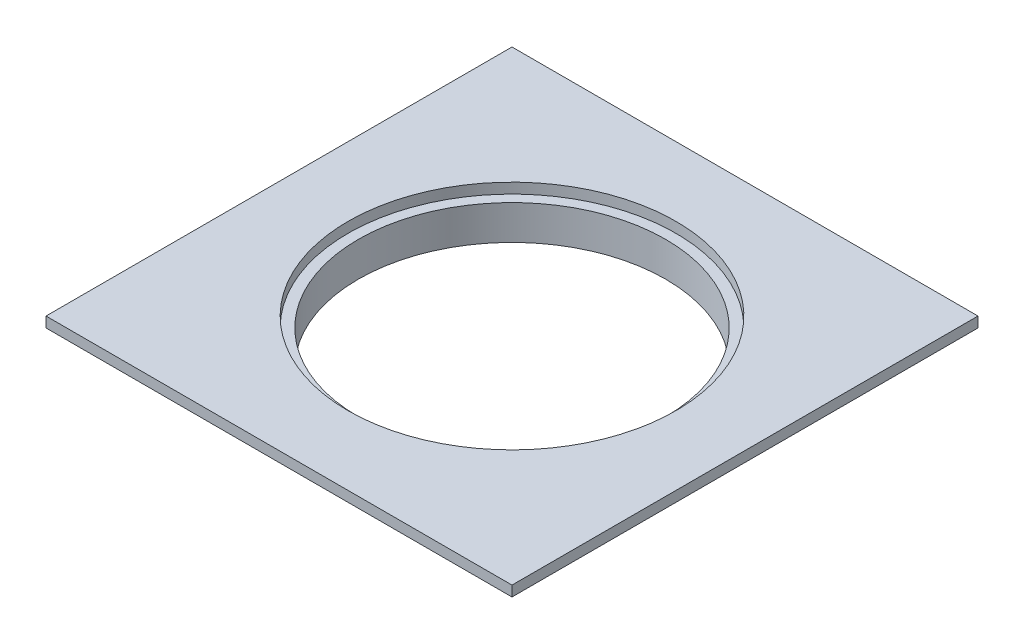
ISO-10303-21;
HEADER;
FILE_DESCRIPTION(('STEP AP214'),'2;1');
FILE_NAME('part.step','',(''),(''),'','','');
FILE_SCHEMA(('AUTOMOTIVE_DESIGN { 1 0 10303 214 1 1 1 1 }'));
ENDSEC;
DATA;
#1=APPLICATION_CONTEXT('core data for automotive mechanical design processes');
#2=APPLICATION_PROTOCOL_DEFINITION('international standard','automotive_design',2000,#1);
#3=PRODUCT_CONTEXT('',#1,'mechanical');
#4=PRODUCT('Part','Part','',(#3));
#5=PRODUCT_RELATED_PRODUCT_CATEGORY('part','',(#4));
#6=PRODUCT_DEFINITION_FORMATION('','',#4);
#7=PRODUCT_DEFINITION_CONTEXT('part definition',#1,'design');
#8=PRODUCT_DEFINITION('design','',#6,#7);
#9=PRODUCT_DEFINITION_SHAPE('','',#8);
#10=(LENGTH_UNIT() NAMED_UNIT(*) SI_UNIT(.MILLI.,.METRE.));
#11=(NAMED_UNIT(*) PLANE_ANGLE_UNIT() SI_UNIT($,.RADIAN.));
#12=(NAMED_UNIT(*) SI_UNIT($,.STERADIAN.) SOLID_ANGLE_UNIT());
#13=UNCERTAINTY_MEASURE_WITH_UNIT(LENGTH_MEASURE(1.E-05),#10,'distance_accuracy_value','');
#14=(GEOMETRIC_REPRESENTATION_CONTEXT(3) GLOBAL_UNCERTAINTY_ASSIGNED_CONTEXT((#13)) GLOBAL_UNIT_ASSIGNED_CONTEXT((#10,
#11,#12)) REPRESENTATION_CONTEXT('',''));
#15=CARTESIAN_POINT('',(0.,0.,0.));
#16=DIRECTION('',(0.,0.,1.));
#17=DIRECTION('',(1.,0.,0.));
#18=AXIS2_PLACEMENT_3D('',#15,#16,#17);
#19=CARTESIAN_POINT('',(0.,3.,0.));
#20=DIRECTION('',(0.,-1.,0.));
#21=DIRECTION('',(0.,0.,-1.));
#22=AXIS2_PLACEMENT_3D('',#19,#20,#21);
#23=PLANE('',#22);
#24=DIRECTION('',(0.,0.,-1.));
#25=VECTOR('',#24,1.);
#26=CARTESIAN_POINT('',(67.5,3.,67.5));
#27=LINE('',#26,#25);
#28=CARTESIAN_POINT('',(67.5,3.,67.5));
#29=VERTEX_POINT('',#28);
#30=CARTESIAN_POINT('',(67.5,3.,-67.5));
#31=VERTEX_POINT('',#30);
#32=EDGE_CURVE('E95',#29,#31,#27,.T.);
#33=ORIENTED_EDGE('',*,*,#32,.T.);
#34=DIRECTION('',(-1.,0.,0.));
#35=VECTOR('',#34,1.);
#36=CARTESIAN_POINT('',(-67.5,3.,-67.5));
#37=LINE('',#36,#35);
#38=CARTESIAN_POINT('',(-67.5,3.,-67.5));
#39=VERTEX_POINT('',#38);
#40=EDGE_CURVE('E90',#31,#39,#37,.T.);
#41=ORIENTED_EDGE('',*,*,#40,.T.);
#42=DIRECTION('',(0.,0.,1.));
#43=VECTOR('',#42,1.);
#44=CARTESIAN_POINT('',(-67.5,3.,67.5));
#45=LINE('',#44,#43);
#46=CARTESIAN_POINT('',(-67.5,3.,67.5));
#47=VERTEX_POINT('',#46);
#48=EDGE_CURVE('E93',#39,#47,#45,.T.);
#49=ORIENTED_EDGE('',*,*,#48,.T.);
#50=DIRECTION('',(1.,0.,0.));
#51=VECTOR('',#50,1.);
#52=CARTESIAN_POINT('',(-67.5,3.,67.5));
#53=LINE('',#52,#51);
#54=EDGE_CURVE('E60',#47,#29,#53,.T.);
#55=ORIENTED_EDGE('',*,*,#54,.T.);
#56=EDGE_LOOP('',(#33,#41,#49,#55));
#57=FACE_BOUND('',#56,.T.);
#58=CARTESIAN_POINT('',(0.,3.,0.));
#59=DIRECTION('',(0.,1.,0.));
#60=DIRECTION('',(0.,0.,1.));
#61=AXIS2_PLACEMENT_3D('',#58,#59,#60);
#62=CIRCLE('',#61,47.5);
#63=CARTESIAN_POINT('',(0.,3.,47.5));
#64=VERTEX_POINT('',#63);
#65=EDGE_CURVE('E110',#64,#64,#62,.T.);
#66=ORIENTED_EDGE('',*,*,#65,.F.);
#67=EDGE_LOOP('',(#66));
#68=FACE_BOUND('',#67,.T.);
#69=ADVANCED_FACE('F43',(#57,#68),#23,.F.);
#70=CARTESIAN_POINT('',(0.,0.,0.));
#71=DIRECTION('',(0.,-1.,0.));
#72=DIRECTION('',(0.,0.,-1.));
#73=AXIS2_PLACEMENT_3D('',#70,#71,#72);
#74=PLANE('',#73);
#75=CARTESIAN_POINT('',(0.,0.,0.));
#76=DIRECTION('',(0.,-1.,0.));
#77=DIRECTION('',(0.,0.,-1.));
#78=AXIS2_PLACEMENT_3D('',#75,#76,#77);
#79=CIRCLE('',#78,55.);
#80=CARTESIAN_POINT('',(0.,0.,-55.));
#81=VERTEX_POINT('',#80);
#82=EDGE_CURVE('E127',#81,#81,#79,.T.);
#83=ORIENTED_EDGE('',*,*,#82,.F.);
#84=EDGE_LOOP('',(#83));
#85=FACE_BOUND('',#84,.T.);
#86=DIRECTION('',(0.,0.,-1.));
#87=VECTOR('',#86,1.);
#88=CARTESIAN_POINT('',(67.5,0.,67.5));
#89=LINE('',#88,#87);
#90=CARTESIAN_POINT('',(67.5,0.,67.5));
#91=VERTEX_POINT('',#90);
#92=CARTESIAN_POINT('',(67.5,0.,-67.5));
#93=VERTEX_POINT('',#92);
#94=EDGE_CURVE('E107',#91,#93,#89,.T.);
#95=ORIENTED_EDGE('',*,*,#94,.F.);
#96=DIRECTION('',(1.,0.,0.));
#97=VECTOR('',#96,1.);
#98=CARTESIAN_POINT('',(-67.5,0.,67.5));
#99=LINE('',#98,#97);
#100=CARTESIAN_POINT('',(-67.5,0.,67.5));
#101=VERTEX_POINT('',#100);
#102=EDGE_CURVE('E83',#101,#91,#99,.T.);
#103=ORIENTED_EDGE('',*,*,#102,.F.);
#104=DIRECTION('',(0.,0.,1.));
#105=VECTOR('',#104,1.);
#106=CARTESIAN_POINT('',(-67.5,0.,67.5));
#107=LINE('',#106,#105);
#108=CARTESIAN_POINT('',(-67.5,0.,-67.5));
#109=VERTEX_POINT('',#108);
#110=EDGE_CURVE('E77',#109,#101,#107,.T.);
#111=ORIENTED_EDGE('',*,*,#110,.F.);
#112=DIRECTION('',(-1.,0.,0.));
#113=VECTOR('',#112,1.);
#114=CARTESIAN_POINT('',(-67.5,0.,-67.5));
#115=LINE('',#114,#113);
#116=EDGE_CURVE('E99',#93,#109,#115,.T.);
#117=ORIENTED_EDGE('',*,*,#116,.F.);
#118=EDGE_LOOP('',(#95,#103,#111,#117));
#119=FACE_BOUND('',#118,.T.);
#120=ADVANCED_FACE('F118',(#85,#119),#74,.T.);
#121=CARTESIAN_POINT('',(67.5,3.,67.5));
#122=DIRECTION('',(-1.,0.,0.));
#123=DIRECTION('',(0.,0.,1.));
#124=AXIS2_PLACEMENT_3D('',#121,#122,#123);
#125=PLANE('',#124);
#126=ORIENTED_EDGE('',*,*,#94,.T.);
#127=DIRECTION('',(0.,-1.,0.));
#128=VECTOR('',#127,1.);
#129=CARTESIAN_POINT('',(67.5,3.,-67.5));
#130=LINE('',#129,#128);
#131=EDGE_CURVE('E12',#31,#93,#130,.T.);
#132=ORIENTED_EDGE('',*,*,#131,.F.);
#133=ORIENTED_EDGE('',*,*,#32,.F.);
#134=DIRECTION('',(0.,-1.,0.));
#135=VECTOR('',#134,1.);
#136=CARTESIAN_POINT('',(67.5,3.,67.5));
#137=LINE('',#136,#135);
#138=EDGE_CURVE('E103',#29,#91,#137,.T.);
#139=ORIENTED_EDGE('',*,*,#138,.T.);
#140=EDGE_LOOP('',(#126,#132,#133,#139));
#141=FACE_BOUND('',#140,.T.);
#142=ADVANCED_FACE('F45',(#141),#125,.F.);
#143=CARTESIAN_POINT('',(-67.5,3.,-67.5));
#144=DIRECTION('',(0.,0.,1.));
#145=DIRECTION('',(1.,0.,0.));
#146=AXIS2_PLACEMENT_3D('',#143,#144,#145);
#147=PLANE('',#146);
#148=ORIENTED_EDGE('',*,*,#116,.T.);
#149=DIRECTION('',(0.,-1.,0.));
#150=VECTOR('',#149,1.);
#151=CARTESIAN_POINT('',(-67.5,3.,-67.5));
#152=LINE('',#151,#150);
#153=EDGE_CURVE('E52',#39,#109,#152,.T.);
#154=ORIENTED_EDGE('',*,*,#153,.F.);
#155=ORIENTED_EDGE('',*,*,#40,.F.);
#156=ORIENTED_EDGE('',*,*,#131,.T.);
#157=EDGE_LOOP('',(#148,#154,#155,#156));
#158=FACE_BOUND('',#157,.T.);
#159=ADVANCED_FACE('F98',(#158),#147,.F.);
#160=CARTESIAN_POINT('',(-67.5,3.,67.5));
#161=DIRECTION('',(1.,0.,0.));
#162=DIRECTION('',(0.,0.,-1.));
#163=AXIS2_PLACEMENT_3D('',#160,#161,#162);
#164=PLANE('',#163);
#165=ORIENTED_EDGE('',*,*,#110,.T.);
#166=DIRECTION('',(0.,-1.,0.));
#167=VECTOR('',#166,1.);
#168=CARTESIAN_POINT('',(-67.5,3.,67.5));
#169=LINE('',#168,#167);
#170=EDGE_CURVE('E100',#47,#101,#169,.T.);
#171=ORIENTED_EDGE('',*,*,#170,.F.);
#172=ORIENTED_EDGE('',*,*,#48,.F.);
#173=ORIENTED_EDGE('',*,*,#153,.T.);
#174=EDGE_LOOP('',(#165,#171,#172,#173));
#175=FACE_BOUND('',#174,.T.);
#176=ADVANCED_FACE('F101',(#175),#164,.F.);
#177=CARTESIAN_POINT('',(-67.5,3.,67.5));
#178=DIRECTION('',(0.,0.,-1.));
#179=DIRECTION('',(-1.,0.,0.));
#180=AXIS2_PLACEMENT_3D('',#177,#178,#179);
#181=PLANE('',#180);
#182=ORIENTED_EDGE('',*,*,#102,.T.);
#183=ORIENTED_EDGE('',*,*,#138,.F.);
#184=ORIENTED_EDGE('',*,*,#54,.F.);
#185=ORIENTED_EDGE('',*,*,#170,.T.);
#186=EDGE_LOOP('',(#182,#183,#184,#185));
#187=FACE_BOUND('',#186,.T.);
#188=ADVANCED_FACE('F115',(#187),#181,.F.);
#189=CARTESIAN_POINT('',(0.,3.,0.));
#190=DIRECTION('',(0.,-1.,0.));
#191=DIRECTION('',(0.,0.,-1.));
#192=AXIS2_PLACEMENT_3D('',#189,#190,#191);
#193=CYLINDRICAL_SURFACE('',#192,47.5);
#194=ORIENTED_EDGE('',*,*,#65,.T.);
#195=EDGE_LOOP('',(#194));
#196=FACE_BOUND('',#195,.T.);
#197=CARTESIAN_POINT('',(0.,0.,0.));
#198=DIRECTION('',(0.,1.,0.));
#199=DIRECTION('',(0.,0.,1.));
#200=AXIS2_PLACEMENT_3D('',#197,#198,#199);
#201=CIRCLE('',#200,47.5);
#202=CARTESIAN_POINT('',(0.,0.,47.5));
#203=VERTEX_POINT('',#202);
#204=EDGE_CURVE('E121',#203,#203,#201,.T.);
#205=ORIENTED_EDGE('',*,*,#204,.F.);
#206=EDGE_LOOP('',(#205));
#207=FACE_BOUND('',#206,.T.);
#208=ADVANCED_FACE('F154',(#196,#207),#193,.F.);
#209=CARTESIAN_POINT('',(0.,0.,0.));
#210=DIRECTION('',(0.,-1.,0.));
#211=DIRECTION('',(0.,0.,-1.));
#212=AXIS2_PLACEMENT_3D('',#209,#210,#211);
#213=PLANE('',#212);
#214=CARTESIAN_POINT('',(0.,0.,0.));
#215=DIRECTION('',(0.,-1.,0.));
#216=DIRECTION('',(0.,0.,-1.));
#217=AXIS2_PLACEMENT_3D('',#214,#215,#216);
#218=CIRCLE('',#217,44.5);
#219=CARTESIAN_POINT('',(0.,0.,-44.5));
#220=VERTEX_POINT('',#219);
#221=EDGE_CURVE('E133',#220,#220,#218,.T.);
#222=ORIENTED_EDGE('',*,*,#221,.T.);
#223=EDGE_LOOP('',(#222));
#224=FACE_BOUND('',#223,.T.);
#225=ORIENTED_EDGE('',*,*,#204,.T.);
#226=EDGE_LOOP('',(#225));
#227=FACE_BOUND('',#226,.T.);
#228=ADVANCED_FACE('F145',(#224,#227),#213,.F.);
#229=CARTESIAN_POINT('',(0.,-10.,0.));
#230=DIRECTION('',(0.,-1.,0.));
#231=DIRECTION('',(0.,0.,-1.));
#232=AXIS2_PLACEMENT_3D('',#229,#230,#231);
#233=PLANE('',#232);
#234=CARTESIAN_POINT('',(0.,-10.,0.));
#235=DIRECTION('',(0.,-1.,0.));
#236=DIRECTION('',(0.,0.,-1.));
#237=AXIS2_PLACEMENT_3D('',#234,#235,#236);
#238=CIRCLE('',#237,55.);
#239=CARTESIAN_POINT('',(0.,-10.,-55.));
#240=VERTEX_POINT('',#239);
#241=EDGE_CURVE('E124',#240,#240,#238,.T.);
#242=ORIENTED_EDGE('',*,*,#241,.T.);
#243=EDGE_LOOP('',(#242));
#244=FACE_BOUND('',#243,.T.);
#245=CARTESIAN_POINT('',(0.,-10.,0.));
#246=DIRECTION('',(0.,-1.,0.));
#247=DIRECTION('',(0.,0.,-1.));
#248=AXIS2_PLACEMENT_3D('',#245,#246,#247);
#249=CIRCLE('',#248,44.5);
#250=CARTESIAN_POINT('',(0.,-10.,-44.5));
#251=VERTEX_POINT('',#250);
#252=EDGE_CURVE('E130',#251,#251,#249,.T.);
#253=ORIENTED_EDGE('',*,*,#252,.F.);
#254=EDGE_LOOP('',(#253));
#255=FACE_BOUND('',#254,.T.);
#256=ADVANCED_FACE('F142',(#244,#255),#233,.T.);
#257=CARTESIAN_POINT('',(0.,-10.,0.));
#258=DIRECTION('',(0.,1.,0.));
#259=DIRECTION('',(0.,0.,1.));
#260=AXIS2_PLACEMENT_3D('',#257,#258,#259);
#261=CYLINDRICAL_SURFACE('',#260,55.);
#262=ORIENTED_EDGE('',*,*,#241,.F.);
#263=EDGE_LOOP('',(#262));
#264=FACE_BOUND('',#263,.T.);
#265=ORIENTED_EDGE('',*,*,#82,.T.);
#266=EDGE_LOOP('',(#265));
#267=FACE_BOUND('',#266,.T.);
#268=ADVANCED_FACE('F144',(#264,#267),#261,.T.);
#269=CARTESIAN_POINT('',(0.,-10.,0.));
#270=DIRECTION('',(0.,1.,0.));
#271=DIRECTION('',(0.,0.,1.));
#272=AXIS2_PLACEMENT_3D('',#269,#270,#271);
#273=CYLINDRICAL_SURFACE('',#272,44.5);
#274=ORIENTED_EDGE('',*,*,#252,.T.);
#275=EDGE_LOOP('',(#274));
#276=FACE_BOUND('',#275,.T.);
#277=ORIENTED_EDGE('',*,*,#221,.F.);
#278=EDGE_LOOP('',(#277));
#279=FACE_BOUND('',#278,.T.);
#280=ADVANCED_FACE('F139',(#276,#279),#273,.F.);
#281=CLOSED_SHELL('',(#69,#120,#142,#159,#176,#188,#208,#228,#256,#268,#280));
#282=MANIFOLD_SOLID_BREP('B2',#281);
#283=ADVANCED_BREP_SHAPE_REPRESENTATION('',(#18,#282),#14);
#284=SHAPE_DEFINITION_REPRESENTATION(#9,#283);
ENDSEC;
END-ISO-10303-21;
